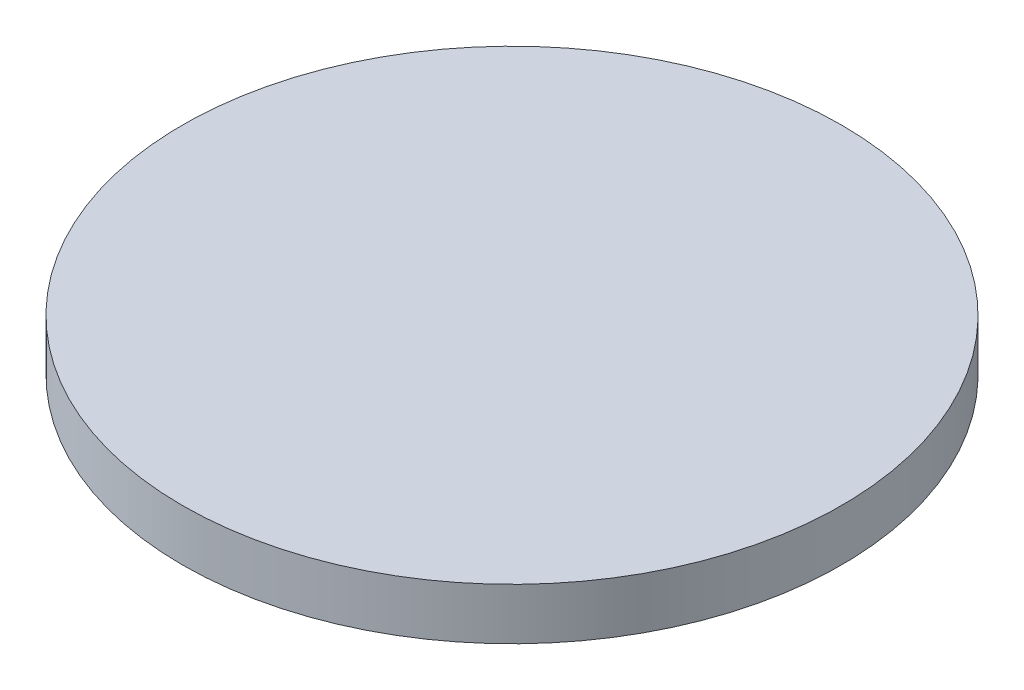
ISO-10303-21;
HEADER;
FILE_DESCRIPTION(('STEP AP214'),'2;1');
FILE_NAME('part.step','',(''),(''),'','','');
FILE_SCHEMA(('AUTOMOTIVE_DESIGN { 1 0 10303 214 1 1 1 1 }'));
ENDSEC;
DATA;
#1=APPLICATION_CONTEXT('core data for automotive mechanical design processes');
#2=APPLICATION_PROTOCOL_DEFINITION('international standard','automotive_design',2000,#1);
#3=PRODUCT_CONTEXT('',#1,'mechanical');
#4=PRODUCT('Part','Part','',(#3));
#5=PRODUCT_RELATED_PRODUCT_CATEGORY('part','',(#4));
#6=PRODUCT_DEFINITION_FORMATION('','',#4);
#7=PRODUCT_DEFINITION_CONTEXT('part definition',#1,'design');
#8=PRODUCT_DEFINITION('design','',#6,#7);
#9=PRODUCT_DEFINITION_SHAPE('','',#8);
#10=(LENGTH_UNIT() NAMED_UNIT(*) SI_UNIT(.MILLI.,.METRE.));
#11=(NAMED_UNIT(*) PLANE_ANGLE_UNIT() SI_UNIT($,.RADIAN.));
#12=(NAMED_UNIT(*) SI_UNIT($,.STERADIAN.) SOLID_ANGLE_UNIT());
#13=UNCERTAINTY_MEASURE_WITH_UNIT(LENGTH_MEASURE(1.E-05),#10,'distance_accuracy_value','');
#14=(GEOMETRIC_REPRESENTATION_CONTEXT(3) GLOBAL_UNCERTAINTY_ASSIGNED_CONTEXT((#13)) GLOBAL_UNIT_ASSIGNED_CONTEXT((#10,
#11,#12)) REPRESENTATION_CONTEXT('',''));
#15=CARTESIAN_POINT('',(0.,0.,0.));
#16=DIRECTION('',(0.,0.,1.));
#17=DIRECTION('',(1.,0.,0.));
#18=AXIS2_PLACEMENT_3D('',#15,#16,#17);
#19=CARTESIAN_POINT('',(0.,3.175,0.));
#20=DIRECTION('',(0.,-1.,0.));
#21=DIRECTION('',(0.,0.,-1.));
#22=AXIS2_PLACEMENT_3D('',#19,#20,#21);
#23=CYLINDRICAL_SURFACE('',#22,20.32);
#24=CARTESIAN_POINT('',(0.,3.175,0.));
#25=DIRECTION('',(0.,1.,0.));
#26=DIRECTION('',(0.,0.,1.));
#27=AXIS2_PLACEMENT_3D('',#24,#25,#26);
#28=CIRCLE('',#27,20.32);
#29=CARTESIAN_POINT('',(0.,3.175,20.32));
#30=VERTEX_POINT('',#29);
#31=EDGE_CURVE('E10',#30,#30,#28,.T.);
#32=ORIENTED_EDGE('',*,*,#31,.F.);
#33=EDGE_LOOP('',(#32));
#34=FACE_BOUND('',#33,.T.);
#35=CARTESIAN_POINT('',(0.,0.,0.));
#36=DIRECTION('',(0.,1.,0.));
#37=DIRECTION('',(0.,0.,1.));
#38=AXIS2_PLACEMENT_3D('',#35,#36,#37);
#39=CIRCLE('',#38,20.32);
#40=CARTESIAN_POINT('',(0.,0.,20.32));
#41=VERTEX_POINT('',#40);
#42=EDGE_CURVE('E34',#41,#41,#39,.T.);
#43=ORIENTED_EDGE('',*,*,#42,.T.);
#44=EDGE_LOOP('',(#43));
#45=FACE_BOUND('',#44,.T.);
#46=ADVANCED_FACE('F31',(#34,#45),#23,.T.);
#47=CARTESIAN_POINT('',(0.,3.175,0.));
#48=DIRECTION('',(0.,1.,0.));
#49=DIRECTION('',(0.,0.,1.));
#50=AXIS2_PLACEMENT_3D('',#47,#48,#49);
#51=PLANE('',#50);
#52=ORIENTED_EDGE('',*,*,#31,.T.);
#53=EDGE_LOOP('',(#52));
#54=FACE_BOUND('',#53,.T.);
#55=ADVANCED_FACE('F46',(#54),#51,.T.);
#56=CARTESIAN_POINT('',(0.,0.,0.));
#57=DIRECTION('',(0.,1.,0.));
#58=DIRECTION('',(0.,0.,1.));
#59=AXIS2_PLACEMENT_3D('',#56,#57,#58);
#60=PLANE('',#59);
#61=ORIENTED_EDGE('',*,*,#42,.F.);
#62=EDGE_LOOP('',(#61));
#63=FACE_BOUND('',#62,.T.);
#64=ADVANCED_FACE('F44',(#63),#60,.F.);
#65=CLOSED_SHELL('',(#46,#55,#64));
#66=MANIFOLD_SOLID_BREP('B2',#65);
#67=ADVANCED_BREP_SHAPE_REPRESENTATION('',(#18,#66),#14);
#68=SHAPE_DEFINITION_REPRESENTATION(#9,#67);
ENDSEC;
END-ISO-10303-21;
